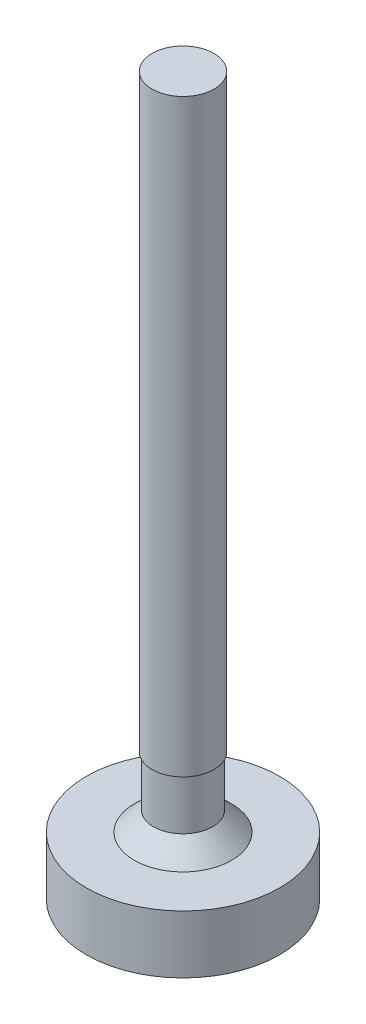
ISO-10303-21;
HEADER;
FILE_DESCRIPTION(('STEP AP214'),'2;1');
FILE_NAME('part.step','',(''),(''),'','','');
FILE_SCHEMA(('AUTOMOTIVE_DESIGN { 1 0 10303 214 1 1 1 1 }'));
ENDSEC;
DATA;
#1=APPLICATION_CONTEXT('core data for automotive mechanical design processes');
#2=APPLICATION_PROTOCOL_DEFINITION('international standard','automotive_design',2000,#1);
#3=PRODUCT_CONTEXT('',#1,'mechanical');
#4=PRODUCT('Part','Part','',(#3));
#5=PRODUCT_RELATED_PRODUCT_CATEGORY('part','',(#4));
#6=PRODUCT_DEFINITION_FORMATION('','',#4);
#7=PRODUCT_DEFINITION_CONTEXT('part definition',#1,'design');
#8=PRODUCT_DEFINITION('design','',#6,#7);
#9=PRODUCT_DEFINITION_SHAPE('','',#8);
#10=(LENGTH_UNIT() NAMED_UNIT(*) SI_UNIT(.MILLI.,.METRE.));
#11=(NAMED_UNIT(*) PLANE_ANGLE_UNIT() SI_UNIT($,.RADIAN.));
#12=(NAMED_UNIT(*) SI_UNIT($,.STERADIAN.) SOLID_ANGLE_UNIT());
#13=UNCERTAINTY_MEASURE_WITH_UNIT(LENGTH_MEASURE(1.E-05),#10,'distance_accuracy_value','');
#14=(GEOMETRIC_REPRESENTATION_CONTEXT(3) GLOBAL_UNCERTAINTY_ASSIGNED_CONTEXT((#13)) GLOBAL_UNIT_ASSIGNED_CONTEXT((#10,
#11,#12)) REPRESENTATION_CONTEXT('',''));
#15=CARTESIAN_POINT('',(0.,0.,0.));
#16=DIRECTION('',(0.,0.,1.));
#17=DIRECTION('',(1.,0.,0.));
#18=AXIS2_PLACEMENT_3D('',#15,#16,#17);
#19=CARTESIAN_POINT('',(0.,3.,0.));
#20=DIRECTION('',(0.,-1.,0.));
#21=DIRECTION('',(0.,0.,-1.));
#22=AXIS2_PLACEMENT_3D('',#19,#20,#21);
#23=CYLINDRICAL_SURFACE('',#22,5.);
#24=CARTESIAN_POINT('',(0.,3.,0.));
#25=DIRECTION('',(0.,1.,0.));
#26=DIRECTION('',(0.,0.,1.));
#27=AXIS2_PLACEMENT_3D('',#24,#25,#26);
#28=CIRCLE('',#27,5.);
#29=CARTESIAN_POINT('',(0.,3.,5.));
#30=VERTEX_POINT('',#29);
#31=EDGE_CURVE('E48',#30,#30,#28,.T.);
#32=ORIENTED_EDGE('',*,*,#31,.F.);
#33=EDGE_LOOP('',(#32));
#34=FACE_BOUND('',#33,.T.);
#35=CARTESIAN_POINT('',(0.,0.,0.));
#36=DIRECTION('',(0.,1.,0.));
#37=DIRECTION('',(0.,0.,1.));
#38=AXIS2_PLACEMENT_3D('',#35,#36,#37);
#39=CIRCLE('',#38,5.);
#40=CARTESIAN_POINT('',(0.,0.,5.));
#41=VERTEX_POINT('',#40);
#42=EDGE_CURVE('E52',#41,#41,#39,.T.);
#43=ORIENTED_EDGE('',*,*,#42,.T.);
#44=EDGE_LOOP('',(#43));
#45=FACE_BOUND('',#44,.T.);
#46=ADVANCED_FACE('F36',(#34,#45),#23,.T.);
#47=CARTESIAN_POINT('',(0.,3.,0.));
#48=DIRECTION('',(0.,1.,0.));
#49=DIRECTION('',(0.,0.,1.));
#50=AXIS2_PLACEMENT_3D('',#47,#48,#49);
#51=PLANE('',#50);
#52=CARTESIAN_POINT('',(0.,3.,0.));
#53=DIRECTION('',(0.,1.,0.));
#54=DIRECTION('',(0.,0.,1.));
#55=AXIS2_PLACEMENT_3D('',#52,#53,#54);
#56=CIRCLE('',#55,2.525);
#57=CARTESIAN_POINT('',(0.,3.,2.525));
#58=VERTEX_POINT('',#57);
#59=EDGE_CURVE('E10',#58,#58,#56,.F.);
#60=ORIENTED_EDGE('',*,*,#59,.T.);
#61=EDGE_LOOP('',(#60));
#62=FACE_BOUND('',#61,.T.);
#63=ORIENTED_EDGE('',*,*,#31,.T.);
#64=EDGE_LOOP('',(#63));
#65=FACE_BOUND('',#64,.T.);
#66=ADVANCED_FACE('F87',(#62,#65),#51,.T.);
#67=CARTESIAN_POINT('',(0.,0.,0.));
#68=DIRECTION('',(0.,1.,0.));
#69=DIRECTION('',(0.,0.,1.));
#70=AXIS2_PLACEMENT_3D('',#67,#68,#69);
#71=PLANE('',#70);
#72=ORIENTED_EDGE('',*,*,#42,.F.);
#73=EDGE_LOOP('',(#72));
#74=FACE_BOUND('',#73,.T.);
#75=ADVANCED_FACE('F92',(#74),#71,.F.);
#76=CARTESIAN_POINT('',(0.,6.6,0.));
#77=DIRECTION('',(0.,-1.,0.));
#78=DIRECTION('',(0.,0.,-1.));
#79=AXIS2_PLACEMENT_3D('',#76,#77,#78);
#80=CYLINDRICAL_SURFACE('',#79,1.525);
#81=CARTESIAN_POINT('',(0.,4.00000000000001,0.));
#82=DIRECTION('',(0.,1.,0.));
#83=DIRECTION('',(0.,0.,1.));
#84=AXIS2_PLACEMENT_3D('',#81,#82,#83);
#85=CIRCLE('',#84,1.525);
#86=CARTESIAN_POINT('',(0.,4.00000000000001,1.525));
#87=VERTEX_POINT('',#86);
#88=EDGE_CURVE('E44',#87,#87,#85,.T.);
#89=ORIENTED_EDGE('',*,*,#88,.T.);
#90=EDGE_LOOP('',(#89));
#91=FACE_BOUND('',#90,.T.);
#92=CARTESIAN_POINT('',(0.,6.6,0.));
#93=DIRECTION('',(0.,1.,0.));
#94=DIRECTION('',(0.,0.,1.));
#95=AXIS2_PLACEMENT_3D('',#92,#93,#94);
#96=CIRCLE('',#95,1.525);
#97=CARTESIAN_POINT('',(0.,6.6,1.525));
#98=VERTEX_POINT('',#97);
#99=EDGE_CURVE('E56',#98,#98,#96,.T.);
#100=ORIENTED_EDGE('',*,*,#99,.F.);
#101=EDGE_LOOP('',(#100));
#102=FACE_BOUND('',#101,.T.);
#103=ADVANCED_FACE('F72',(#91,#102),#80,.T.);
#104=CARTESIAN_POINT('',(0.,37.08,0.));
#105=DIRECTION('',(0.,-1.,0.));
#106=DIRECTION('',(0.,0.,-1.));
#107=AXIS2_PLACEMENT_3D('',#104,#105,#106);
#108=CYLINDRICAL_SURFACE('',#107,1.6);
#109=CARTESIAN_POINT('',(0.,37.08,0.));
#110=DIRECTION('',(0.,1.,0.));
#111=DIRECTION('',(0.,0.,1.));
#112=AXIS2_PLACEMENT_3D('',#109,#110,#111);
#113=CIRCLE('',#112,1.6);
#114=CARTESIAN_POINT('',(0.,37.08,1.6));
#115=VERTEX_POINT('',#114);
#116=EDGE_CURVE('E60',#115,#115,#113,.T.);
#117=ORIENTED_EDGE('',*,*,#116,.F.);
#118=EDGE_LOOP('',(#117));
#119=FACE_BOUND('',#118,.T.);
#120=CARTESIAN_POINT('',(0.,6.6,0.));
#121=DIRECTION('',(0.,1.,0.));
#122=DIRECTION('',(0.,0.,1.));
#123=AXIS2_PLACEMENT_3D('',#120,#121,#122);
#124=CIRCLE('',#123,1.6);
#125=CARTESIAN_POINT('',(0.,6.6,1.6));
#126=VERTEX_POINT('',#125);
#127=EDGE_CURVE('E61',#126,#126,#124,.T.);
#128=ORIENTED_EDGE('',*,*,#127,.T.);
#129=EDGE_LOOP('',(#128));
#130=FACE_BOUND('',#129,.T.);
#131=ADVANCED_FACE('F69',(#119,#130),#108,.T.);
#132=CARTESIAN_POINT('',(0.,37.08,0.));
#133=DIRECTION('',(0.,1.,0.));
#134=DIRECTION('',(0.,0.,1.));
#135=AXIS2_PLACEMENT_3D('',#132,#133,#134);
#136=PLANE('',#135);
#137=ORIENTED_EDGE('',*,*,#116,.T.);
#138=EDGE_LOOP('',(#137));
#139=FACE_BOUND('',#138,.T.);
#140=ADVANCED_FACE('F67',(#139),#136,.T.);
#141=CARTESIAN_POINT('',(0.,6.6,0.));
#142=DIRECTION('',(0.,1.,0.));
#143=DIRECTION('',(0.,0.,1.));
#144=AXIS2_PLACEMENT_3D('',#141,#142,#143);
#145=PLANE('',#144);
#146=ORIENTED_EDGE('',*,*,#99,.T.);
#147=EDGE_LOOP('',(#146));
#148=FACE_BOUND('',#147,.T.);
#149=ORIENTED_EDGE('',*,*,#127,.F.);
#150=EDGE_LOOP('',(#149));
#151=FACE_BOUND('',#150,.T.);
#152=ADVANCED_FACE('F76',(#148,#151),#145,.F.);
#153=CARTESIAN_POINT('',(0.,4.00000000000001,0.));
#154=DIRECTION('',(0.,-1.,0.));
#155=DIRECTION('',(0.,0.,-1.));
#156=AXIS2_PLACEMENT_3D('',#153,#154,#155);
#157=CONICAL_SURFACE('',#156,1.525,0.785398163397443);
#158=ORIENTED_EDGE('',*,*,#59,.F.);
#159=EDGE_LOOP('',(#158));
#160=FACE_BOUND('',#159,.T.);
#161=ORIENTED_EDGE('',*,*,#88,.F.);
#162=EDGE_LOOP('',(#161));
#163=FACE_BOUND('',#162,.T.);
#164=ADVANCED_FACE('F39',(#160,#163),#157,.T.);
#165=CLOSED_SHELL('',(#46,#66,#75,#103,#131,#140,#152,#164));
#166=MANIFOLD_SOLID_BREP('B2',#165);
#167=ADVANCED_BREP_SHAPE_REPRESENTATION('',(#18,#166),#14);
#168=SHAPE_DEFINITION_REPRESENTATION(#9,#167);
ENDSEC;
END-ISO-10303-21;
